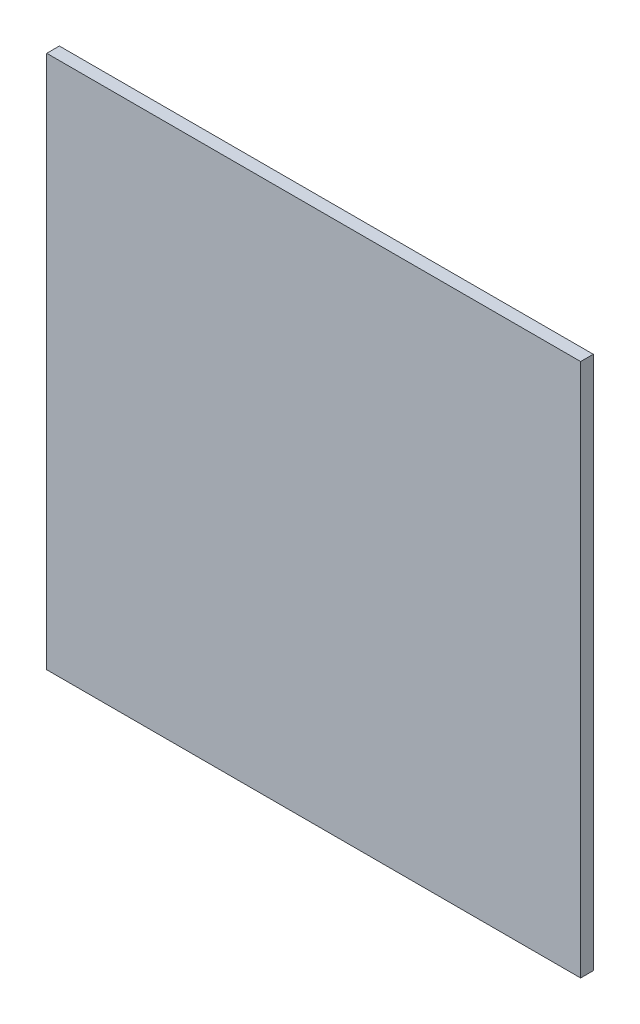
ISO-10303-21;
HEADER;
FILE_DESCRIPTION(('STEP AP214'),'2;1');
FILE_NAME('part.step','',(''),(''),'','','');
FILE_SCHEMA(('AUTOMOTIVE_DESIGN { 1 0 10303 214 1 1 1 1 }'));
ENDSEC;
DATA;
#1=APPLICATION_CONTEXT('core data for automotive mechanical design processes');
#2=APPLICATION_PROTOCOL_DEFINITION('international standard','automotive_design',2000,#1);
#3=PRODUCT_CONTEXT('',#1,'mechanical');
#4=PRODUCT('Part','Part','',(#3));
#5=PRODUCT_RELATED_PRODUCT_CATEGORY('part','',(#4));
#6=PRODUCT_DEFINITION_FORMATION('','',#4);
#7=PRODUCT_DEFINITION_CONTEXT('part definition',#1,'design');
#8=PRODUCT_DEFINITION('design','',#6,#7);
#9=PRODUCT_DEFINITION_SHAPE('','',#8);
#10=(LENGTH_UNIT() NAMED_UNIT(*) SI_UNIT(.MILLI.,.METRE.));
#11=(NAMED_UNIT(*) PLANE_ANGLE_UNIT() SI_UNIT($,.RADIAN.));
#12=(NAMED_UNIT(*) SI_UNIT($,.STERADIAN.) SOLID_ANGLE_UNIT());
#13=UNCERTAINTY_MEASURE_WITH_UNIT(LENGTH_MEASURE(1.E-05),#10,'distance_accuracy_value','');
#14=(GEOMETRIC_REPRESENTATION_CONTEXT(3) GLOBAL_UNCERTAINTY_ASSIGNED_CONTEXT((#13)) GLOBAL_UNIT_ASSIGNED_CONTEXT((#10,
#11,#12)) REPRESENTATION_CONTEXT('',''));
#15=CARTESIAN_POINT('',(0.,0.,0.));
#16=DIRECTION('',(0.,0.,1.));
#17=DIRECTION('',(1.,0.,0.));
#18=AXIS2_PLACEMENT_3D('',#15,#16,#17);
#19=CARTESIAN_POINT('',(8.57508,7.575,0.));
#20=DIRECTION('',(0.,0.,-1.));
#21=DIRECTION('',(-1.,0.,0.));
#22=AXIS2_PLACEMENT_3D('',#19,#20,#21);
#23=PLANE('',#22);
#24=DIRECTION('',(1.,0.,0.));
#25=VECTOR('',#24,1.);
#26=CARTESIAN_POINT('',(7.85008,8.3,0.));
#27=LINE('',#26,#25);
#28=CARTESIAN_POINT('',(7.85008,8.3,0.));
#29=VERTEX_POINT('',#28);
#30=CARTESIAN_POINT('',(9.30008,8.3,0.));
#31=VERTEX_POINT('',#30);
#32=EDGE_CURVE('E55',#29,#31,#27,.T.);
#33=ORIENTED_EDGE('',*,*,#32,.T.);
#34=DIRECTION('',(0.,1.,0.));
#35=VECTOR('',#34,1.);
#36=CARTESIAN_POINT('',(9.30008,8.3,0.));
#37=LINE('',#36,#35);
#38=CARTESIAN_POINT('',(9.30008,6.85,0.));
#39=VERTEX_POINT('',#38);
#40=EDGE_CURVE('E57',#31,#39,#37,.F.);
#41=ORIENTED_EDGE('',*,*,#40,.T.);
#42=DIRECTION('',(1.,0.,0.));
#43=VECTOR('',#42,1.);
#44=CARTESIAN_POINT('',(9.30008,6.85,0.));
#45=LINE('',#44,#43);
#46=CARTESIAN_POINT('',(7.85008,6.85,0.));
#47=VERTEX_POINT('',#46);
#48=EDGE_CURVE('E20',#39,#47,#45,.F.);
#49=ORIENTED_EDGE('',*,*,#48,.T.);
#50=DIRECTION('',(0.,1.,0.));
#51=VECTOR('',#50,1.);
#52=CARTESIAN_POINT('',(7.85008,6.85,0.));
#53=LINE('',#52,#51);
#54=EDGE_CURVE('E80',#47,#29,#53,.T.);
#55=ORIENTED_EDGE('',*,*,#54,.T.);
#56=EDGE_LOOP('',(#33,#41,#49,#55));
#57=FACE_BOUND('',#56,.T.);
#58=ADVANCED_FACE('F17',(#57),#23,.T.);
#59=CARTESIAN_POINT('',(9.30008,6.85,0.));
#60=DIRECTION('',(0.,1.,0.));
#61=DIRECTION('',(0.,0.,1.));
#62=AXIS2_PLACEMENT_3D('',#59,#60,#61);
#63=PLANE('',#62);
#64=DIRECTION('',(0.,0.,-1.));
#65=VECTOR('',#64,1.);
#66=CARTESIAN_POINT('',(7.85008,6.85,0.));
#67=LINE('',#66,#65);
#68=CARTESIAN_POINT('',(7.85008,6.85,0.03429));
#69=VERTEX_POINT('',#68);
#70=EDGE_CURVE('E68',#69,#47,#67,.T.);
#71=ORIENTED_EDGE('',*,*,#70,.T.);
#72=ORIENTED_EDGE('',*,*,#48,.F.);
#73=DIRECTION('',(0.,0.,1.));
#74=VECTOR('',#73,1.);
#75=CARTESIAN_POINT('',(9.30008,6.85,0.));
#76=LINE('',#75,#74);
#77=CARTESIAN_POINT('',(9.30008,6.85,0.03429));
#78=VERTEX_POINT('',#77);
#79=EDGE_CURVE('E63',#39,#78,#76,.T.);
#80=ORIENTED_EDGE('',*,*,#79,.T.);
#81=DIRECTION('',(1.,0.,0.));
#82=VECTOR('',#81,1.);
#83=CARTESIAN_POINT('',(8.57508,6.85,0.03429));
#84=LINE('',#83,#82);
#85=EDGE_CURVE('E83',#69,#78,#84,.T.);
#86=ORIENTED_EDGE('',*,*,#85,.F.);
#87=EDGE_LOOP('',(#71,#72,#80,#86));
#88=FACE_BOUND('',#87,.T.);
#89=ADVANCED_FACE('F65',(#88),#63,.F.);
#90=CARTESIAN_POINT('',(9.30008,8.3,0.));
#91=DIRECTION('',(-1.,0.,0.));
#92=DIRECTION('',(0.,0.,1.));
#93=AXIS2_PLACEMENT_3D('',#90,#91,#92);
#94=PLANE('',#93);
#95=ORIENTED_EDGE('',*,*,#79,.F.);
#96=ORIENTED_EDGE('',*,*,#40,.F.);
#97=DIRECTION('',(0.,0.,-1.));
#98=VECTOR('',#97,1.);
#99=CARTESIAN_POINT('',(9.30008,8.3,0.));
#100=LINE('',#99,#98);
#101=CARTESIAN_POINT('',(9.30008,8.3,0.03429));
#102=VERTEX_POINT('',#101);
#103=EDGE_CURVE('E75',#31,#102,#100,.F.);
#104=ORIENTED_EDGE('',*,*,#103,.T.);
#105=DIRECTION('',(0.,1.,0.));
#106=VECTOR('',#105,1.);
#107=CARTESIAN_POINT('',(9.30008,7.575,0.03429));
#108=LINE('',#107,#106);
#109=EDGE_CURVE('E72',#78,#102,#108,.T.);
#110=ORIENTED_EDGE('',*,*,#109,.F.);
#111=EDGE_LOOP('',(#95,#96,#104,#110));
#112=FACE_BOUND('',#111,.T.);
#113=ADVANCED_FACE('F70',(#112),#94,.F.);
#114=CARTESIAN_POINT('',(7.85008,8.3,0.));
#115=DIRECTION('',(0.,-1.,0.));
#116=DIRECTION('',(0.,0.,-1.));
#117=AXIS2_PLACEMENT_3D('',#114,#115,#116);
#118=PLANE('',#117);
#119=ORIENTED_EDGE('',*,*,#103,.F.);
#120=ORIENTED_EDGE('',*,*,#32,.F.);
#121=DIRECTION('',(0.,0.,-1.));
#122=VECTOR('',#121,1.);
#123=CARTESIAN_POINT('',(7.85008,8.3,0.));
#124=LINE('',#123,#122);
#125=CARTESIAN_POINT('',(7.85008,8.3,0.03429));
#126=VERTEX_POINT('',#125);
#127=EDGE_CURVE('E35',#29,#126,#124,.F.);
#128=ORIENTED_EDGE('',*,*,#127,.T.);
#129=DIRECTION('',(1.,0.,0.));
#130=VECTOR('',#129,1.);
#131=CARTESIAN_POINT('',(8.57508,8.3,0.03429));
#132=LINE('',#131,#130);
#133=EDGE_CURVE('E26',#102,#126,#132,.F.);
#134=ORIENTED_EDGE('',*,*,#133,.F.);
#135=EDGE_LOOP('',(#119,#120,#128,#134));
#136=FACE_BOUND('',#135,.T.);
#137=ADVANCED_FACE('F89',(#136),#118,.F.);
#138=CARTESIAN_POINT('',(7.85008,6.85,0.));
#139=DIRECTION('',(1.,0.,0.));
#140=DIRECTION('',(0.,0.,-1.));
#141=AXIS2_PLACEMENT_3D('',#138,#139,#140);
#142=PLANE('',#141);
#143=ORIENTED_EDGE('',*,*,#127,.F.);
#144=ORIENTED_EDGE('',*,*,#54,.F.);
#145=ORIENTED_EDGE('',*,*,#70,.F.);
#146=DIRECTION('',(0.,1.,0.));
#147=VECTOR('',#146,1.);
#148=CARTESIAN_POINT('',(7.85008,7.575,0.03429));
#149=LINE('',#148,#147);
#150=EDGE_CURVE('E11',#126,#69,#149,.F.);
#151=ORIENTED_EDGE('',*,*,#150,.F.);
#152=EDGE_LOOP('',(#143,#144,#145,#151));
#153=FACE_BOUND('',#152,.T.);
#154=ADVANCED_FACE('F91',(#153),#142,.F.);
#155=CARTESIAN_POINT('',(8.57508,7.575,0.03429));
#156=DIRECTION('',(0.,0.,1.));
#157=DIRECTION('',(1.,0.,0.));
#158=AXIS2_PLACEMENT_3D('',#155,#156,#157);
#159=PLANE('',#158);
#160=ORIENTED_EDGE('',*,*,#133,.T.);
#161=ORIENTED_EDGE('',*,*,#150,.T.);
#162=ORIENTED_EDGE('',*,*,#85,.T.);
#163=ORIENTED_EDGE('',*,*,#109,.T.);
#164=EDGE_LOOP('',(#160,#161,#162,#163));
#165=FACE_BOUND('',#164,.T.);
#166=ADVANCED_FACE('F88',(#165),#159,.T.);
#167=CLOSED_SHELL('',(#58,#89,#113,#137,#154,#166));
#168=MANIFOLD_SOLID_BREP('B1',#167);
#169=ADVANCED_BREP_SHAPE_REPRESENTATION('',(#18,#168),#14);
#170=SHAPE_DEFINITION_REPRESENTATION(#9,#169);
ENDSEC;
END-ISO-10303-21;
